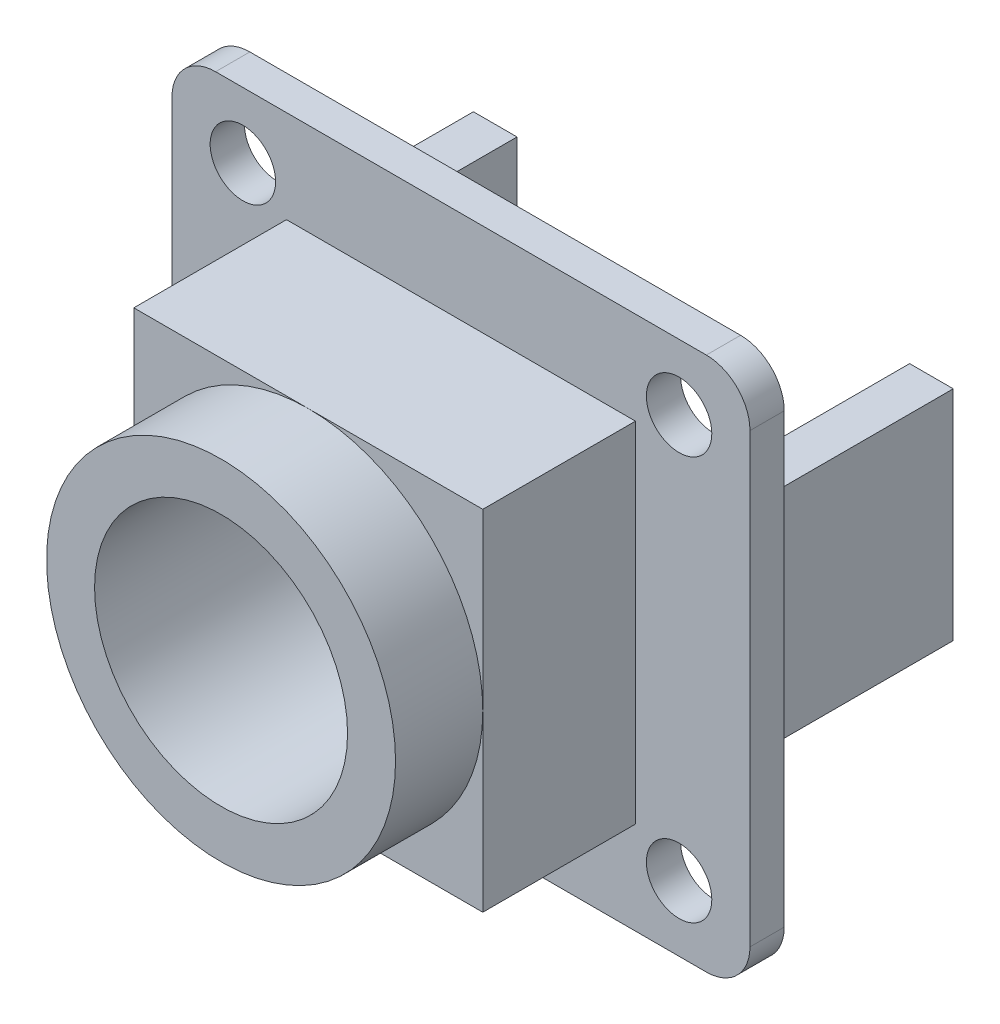
ISO-10303-21;
HEADER;
FILE_DESCRIPTION(('STEP AP214'),'2;1');
FILE_NAME('part.step','',(''),(''),'','','');
FILE_SCHEMA(('AUTOMOTIVE_DESIGN { 1 0 10303 214 1 1 1 1 }'));
ENDSEC;
DATA;
#1=APPLICATION_CONTEXT('core data for automotive mechanical design processes');
#2=APPLICATION_PROTOCOL_DEFINITION('international standard','automotive_design',2000,#1);
#3=PRODUCT_CONTEXT('',#1,'mechanical');
#4=PRODUCT('Part','Part','',(#3));
#5=PRODUCT_RELATED_PRODUCT_CATEGORY('part','',(#4));
#6=PRODUCT_DEFINITION_FORMATION('','',#4);
#7=PRODUCT_DEFINITION_CONTEXT('part definition',#1,'design');
#8=PRODUCT_DEFINITION('design','',#6,#7);
#9=PRODUCT_DEFINITION_SHAPE('','',#8);
#10=(LENGTH_UNIT() NAMED_UNIT(*) SI_UNIT(.MILLI.,.METRE.));
#11=(NAMED_UNIT(*) PLANE_ANGLE_UNIT() SI_UNIT($,.RADIAN.));
#12=(NAMED_UNIT(*) SI_UNIT($,.STERADIAN.) SOLID_ANGLE_UNIT());
#13=UNCERTAINTY_MEASURE_WITH_UNIT(LENGTH_MEASURE(1.E-05),#10,'distance_accuracy_value','');
#14=(GEOMETRIC_REPRESENTATION_CONTEXT(3) GLOBAL_UNCERTAINTY_ASSIGNED_CONTEXT((#13)) GLOBAL_UNIT_ASSIGNED_CONTEXT((#10,
#11,#12)) REPRESENTATION_CONTEXT('',''));
#15=CARTESIAN_POINT('',(0.,0.,0.));
#16=DIRECTION('',(0.,0.,1.));
#17=DIRECTION('',(1.,0.,0.));
#18=AXIS2_PLACEMENT_3D('',#15,#16,#17);
#19=CARTESIAN_POINT('',(0.,0.,8.57));
#20=DIRECTION('',(0.,0.,1.));
#21=DIRECTION('',(1.,0.,0.));
#22=AXIS2_PLACEMENT_3D('',#19,#20,#21);
#23=PLANE('',#22);
#24=CARTESIAN_POINT('',(0.,0.,8.57));
#25=DIRECTION('',(0.,0.,1.));
#26=DIRECTION('',(1.,0.,0.));
#27=AXIS2_PLACEMENT_3D('',#24,#25,#26);
#28=CIRCLE('',#27,8.);
#29=CARTESIAN_POINT('',(8.,0.,8.57));
#30=VERTEX_POINT('',#29);
#31=CARTESIAN_POINT('',(0.,8.,8.57));
#32=VERTEX_POINT('',#31);
#33=EDGE_CURVE('E258',#30,#32,#28,.T.);
#34=ORIENTED_EDGE('',*,*,#33,.F.);
#35=DIRECTION('',(0.,1.,0.));
#36=VECTOR('',#35,1.);
#37=CARTESIAN_POINT('',(8.00000000000001,-8.00000000000001,8.57));
#38=LINE('',#37,#36);
#39=CARTESIAN_POINT('',(8.,8.,8.57));
#40=VERTEX_POINT('',#39);
#41=EDGE_CURVE('E270',#30,#40,#38,.T.);
#42=ORIENTED_EDGE('',*,*,#41,.T.);
#43=DIRECTION('',(-1.,0.,0.));
#44=VECTOR('',#43,1.);
#45=CARTESIAN_POINT('',(8.,8.,8.57));
#46=LINE('',#45,#44);
#47=EDGE_CURVE('E275',#40,#32,#46,.T.);
#48=ORIENTED_EDGE('',*,*,#47,.T.);
#49=EDGE_LOOP('',(#34,#42,#48));
#50=FACE_BOUND('',#49,.T.);
#51=ADVANCED_FACE('F34',(#50),#23,.T.);
#52=CARTESIAN_POINT('',(-8.,0.,8.57));
#53=VERTEX_POINT('',#52);
#54=EDGE_CURVE('E262',#32,#53,#28,.T.);
#55=ORIENTED_EDGE('',*,*,#54,.F.);
#56=CARTESIAN_POINT('',(-8.,8.,8.57));
#57=VERTEX_POINT('',#56);
#58=EDGE_CURVE('E274',#32,#57,#46,.T.);
#59=ORIENTED_EDGE('',*,*,#58,.T.);
#60=DIRECTION('',(0.,-1.,0.));
#61=VECTOR('',#60,1.);
#62=CARTESIAN_POINT('',(-8.,8.,8.57));
#63=LINE('',#62,#61);
#64=EDGE_CURVE('E279',#57,#53,#63,.T.);
#65=ORIENTED_EDGE('',*,*,#64,.T.);
#66=EDGE_LOOP('',(#55,#59,#65));
#67=FACE_BOUND('',#66,.T.);
#68=ADVANCED_FACE('F431',(#67),#23,.T.);
#69=CARTESIAN_POINT('',(0.,-8.00000000000001,8.57));
#70=VERTEX_POINT('',#69);
#71=EDGE_CURVE('E465',#53,#70,#28,.T.);
#72=ORIENTED_EDGE('',*,*,#71,.F.);
#73=CARTESIAN_POINT('',(-8.,-8.00000000000001,8.57));
#74=VERTEX_POINT('',#73);
#75=EDGE_CURVE('E278',#53,#74,#63,.T.);
#76=ORIENTED_EDGE('',*,*,#75,.T.);
#77=DIRECTION('',(1.,0.,0.));
#78=VECTOR('',#77,1.);
#79=CARTESIAN_POINT('',(-8.,-8.00000000000001,8.57));
#80=LINE('',#79,#78);
#81=EDGE_CURVE('E267',#74,#70,#80,.T.);
#82=ORIENTED_EDGE('',*,*,#81,.T.);
#83=EDGE_LOOP('',(#72,#76,#82));
#84=FACE_BOUND('',#83,.T.);
#85=ADVANCED_FACE('F438',(#84),#23,.T.);
#86=CARTESIAN_POINT('',(0.,0.,1.57));
#87=DIRECTION('',(0.,0.,1.));
#88=DIRECTION('',(1.,0.,0.));
#89=AXIS2_PLACEMENT_3D('',#86,#87,#88);
#90=PLANE('',#89);
#91=CARTESIAN_POINT('',(10.,-9.25,1.57));
#92=DIRECTION('',(0.,0.,1.));
#93=DIRECTION('',(1.,0.,0.));
#94=AXIS2_PLACEMENT_3D('',#91,#92,#93);
#95=CIRCLE('',#94,1.5);
#96=CARTESIAN_POINT('',(11.5,-9.25,1.57));
#97=VERTEX_POINT('',#96);
#98=EDGE_CURVE('E308',#97,#97,#95,.T.);
#99=ORIENTED_EDGE('',*,*,#98,.F.);
#100=EDGE_LOOP('',(#99));
#101=FACE_BOUND('',#100,.T.);
#102=CARTESIAN_POINT('',(-10.,9.25,1.57));
#103=DIRECTION('',(0.,0.,1.));
#104=DIRECTION('',(1.,0.,0.));
#105=AXIS2_PLACEMENT_3D('',#102,#103,#104);
#106=CIRCLE('',#105,1.5);
#107=CARTESIAN_POINT('',(-8.5,9.25,1.57));
#108=VERTEX_POINT('',#107);
#109=EDGE_CURVE('E320',#108,#108,#106,.T.);
#110=ORIENTED_EDGE('',*,*,#109,.F.);
#111=EDGE_LOOP('',(#110));
#112=FACE_BOUND('',#111,.T.);
#113=DIRECTION('',(1.,0.,0.));
#114=VECTOR('',#113,1.);
#115=CARTESIAN_POINT('',(-13.25,-12.25,1.57));
#116=LINE('',#115,#114);
#117=CARTESIAN_POINT('',(-11.25,-12.25,1.57));
#118=VERTEX_POINT('',#117);
#119=CARTESIAN_POINT('',(11.25,-12.25,1.57));
#120=VERTEX_POINT('',#119);
#121=EDGE_CURVE('E336',#118,#120,#116,.T.);
#122=ORIENTED_EDGE('',*,*,#121,.T.);
#123=CARTESIAN_POINT('',(11.25,-10.25,1.57));
#124=DIRECTION('',(0.,0.,1.));
#125=DIRECTION('',(1.,0.,0.));
#126=AXIS2_PLACEMENT_3D('',#123,#124,#125);
#127=CIRCLE('',#126,2.);
#128=CARTESIAN_POINT('',(13.25,-10.25,1.57));
#129=VERTEX_POINT('',#128);
#130=EDGE_CURVE('E373',#120,#129,#127,.T.);
#131=ORIENTED_EDGE('',*,*,#130,.T.);
#132=DIRECTION('',(0.,1.,0.));
#133=VECTOR('',#132,1.);
#134=CARTESIAN_POINT('',(13.25,12.25,1.57));
#135=LINE('',#134,#133);
#136=CARTESIAN_POINT('',(13.25,10.25,1.57));
#137=VERTEX_POINT('',#136);
#138=EDGE_CURVE('E326',#129,#137,#135,.T.);
#139=ORIENTED_EDGE('',*,*,#138,.T.);
#140=CARTESIAN_POINT('',(11.25,10.25,1.57));
#141=DIRECTION('',(0.,0.,1.));
#142=DIRECTION('',(1.,0.,0.));
#143=AXIS2_PLACEMENT_3D('',#140,#141,#142);
#144=CIRCLE('',#143,2.);
#145=CARTESIAN_POINT('',(11.25,12.25,1.57));
#146=VERTEX_POINT('',#145);
#147=EDGE_CURVE('E371',#137,#146,#144,.T.);
#148=ORIENTED_EDGE('',*,*,#147,.T.);
#149=DIRECTION('',(-1.,0.,0.));
#150=VECTOR('',#149,1.);
#151=CARTESIAN_POINT('',(-13.25,12.25,1.57));
#152=LINE('',#151,#150);
#153=CARTESIAN_POINT('',(-11.25,12.25,1.57));
#154=VERTEX_POINT('',#153);
#155=EDGE_CURVE('E329',#146,#154,#152,.T.);
#156=ORIENTED_EDGE('',*,*,#155,.T.);
#157=CARTESIAN_POINT('',(-11.25,10.25,1.57));
#158=DIRECTION('',(0.,0.,1.));
#159=DIRECTION('',(1.,0.,0.));
#160=AXIS2_PLACEMENT_3D('',#157,#158,#159);
#161=CIRCLE('',#160,2.);
#162=CARTESIAN_POINT('',(-13.25,10.25,1.57));
#163=VERTEX_POINT('',#162);
#164=EDGE_CURVE('E367',#154,#163,#161,.T.);
#165=ORIENTED_EDGE('',*,*,#164,.T.);
#166=DIRECTION('',(0.,-1.,0.));
#167=VECTOR('',#166,1.);
#168=CARTESIAN_POINT('',(-13.25,12.25,1.57));
#169=LINE('',#168,#167);
#170=CARTESIAN_POINT('',(-13.25,-10.25,1.57));
#171=VERTEX_POINT('',#170);
#172=EDGE_CURVE('E333',#163,#171,#169,.T.);
#173=ORIENTED_EDGE('',*,*,#172,.T.);
#174=CARTESIAN_POINT('',(-11.25,-10.25,1.57));
#175=DIRECTION('',(0.,0.,1.));
#176=DIRECTION('',(1.,0.,0.));
#177=AXIS2_PLACEMENT_3D('',#174,#175,#176);
#178=CIRCLE('',#177,2.);
#179=EDGE_CURVE('E369',#171,#118,#178,.T.);
#180=ORIENTED_EDGE('',*,*,#179,.T.);
#181=EDGE_LOOP('',(#122,#131,#139,#148,#156,#165,#173,#180));
#182=FACE_BOUND('',#181,.T.);
#183=CARTESIAN_POINT('',(10.,9.25,1.57));
#184=DIRECTION('',(0.,0.,1.));
#185=DIRECTION('',(1.,0.,0.));
#186=AXIS2_PLACEMENT_3D('',#183,#184,#185);
#187=CIRCLE('',#186,1.5);
#188=CARTESIAN_POINT('',(11.5,9.25,1.57));
#189=VERTEX_POINT('',#188);
#190=EDGE_CURVE('E314',#189,#189,#187,.T.);
#191=ORIENTED_EDGE('',*,*,#190,.F.);
#192=EDGE_LOOP('',(#191));
#193=FACE_BOUND('',#192,.T.);
#194=CARTESIAN_POINT('',(-10.,-9.25,1.57));
#195=DIRECTION('',(0.,0.,1.));
#196=DIRECTION('',(1.,0.,0.));
#197=AXIS2_PLACEMENT_3D('',#194,#195,#196);
#198=CIRCLE('',#197,1.5);
#199=CARTESIAN_POINT('',(-8.5,-9.25,1.57));
#200=VERTEX_POINT('',#199);
#201=EDGE_CURVE('E302',#200,#200,#198,.T.);
#202=ORIENTED_EDGE('',*,*,#201,.F.);
#203=EDGE_LOOP('',(#202));
#204=FACE_BOUND('',#203,.T.);
#205=DIRECTION('',(0.,1.,0.));
#206=VECTOR('',#205,1.);
#207=CARTESIAN_POINT('',(8.00000000000001,-8.00000000000001,1.57));
#208=LINE('',#207,#206);
#209=CARTESIAN_POINT('',(8.00000000000001,-8.00000000000001,1.57));
#210=VERTEX_POINT('',#209);
#211=CARTESIAN_POINT('',(8.,8.,1.57));
#212=VERTEX_POINT('',#211);
#213=EDGE_CURVE('E285',#210,#212,#208,.T.);
#214=ORIENTED_EDGE('',*,*,#213,.F.);
#215=DIRECTION('',(1.,0.,0.));
#216=VECTOR('',#215,1.);
#217=CARTESIAN_POINT('',(-8.,-8.00000000000001,1.57));
#218=LINE('',#217,#216);
#219=CARTESIAN_POINT('',(-8.,-8.00000000000001,1.57));
#220=VERTEX_POINT('',#219);
#221=EDGE_CURVE('E266',#220,#210,#218,.T.);
#222=ORIENTED_EDGE('',*,*,#221,.F.);
#223=DIRECTION('',(0.,-1.,0.));
#224=VECTOR('',#223,1.);
#225=CARTESIAN_POINT('',(-8.,8.,1.57));
#226=LINE('',#225,#224);
#227=CARTESIAN_POINT('',(-8.,8.,1.57));
#228=VERTEX_POINT('',#227);
#229=EDGE_CURVE('E290',#228,#220,#226,.T.);
#230=ORIENTED_EDGE('',*,*,#229,.F.);
#231=DIRECTION('',(-1.,0.,0.));
#232=VECTOR('',#231,1.);
#233=CARTESIAN_POINT('',(8.,8.,1.57));
#234=LINE('',#233,#232);
#235=EDGE_CURVE('E287',#212,#228,#234,.T.);
#236=ORIENTED_EDGE('',*,*,#235,.F.);
#237=EDGE_LOOP('',(#214,#222,#230,#236));
#238=FACE_BOUND('',#237,.T.);
#239=ADVANCED_FACE('F404',(#101,#112,#182,#193,#204,#238),#90,.T.);
#240=CARTESIAN_POINT('',(0.,0.,0.));
#241=DIRECTION('',(0.,0.,1.));
#242=DIRECTION('',(1.,0.,0.));
#243=AXIS2_PLACEMENT_3D('',#240,#241,#242);
#244=PLANE('',#243);
#245=DIRECTION('',(1.,0.,0.));
#246=VECTOR('',#245,1.);
#247=CARTESIAN_POINT('',(0.,5.,0.));
#248=LINE('',#247,#246);
#249=CARTESIAN_POINT('',(-11.,5.,0.));
#250=VERTEX_POINT('',#249);
#251=CARTESIAN_POINT('',(-9.,5.,0.));
#252=VERTEX_POINT('',#251);
#253=EDGE_CURVE('E216',#250,#252,#248,.T.);
#254=ORIENTED_EDGE('',*,*,#253,.F.);
#255=DIRECTION('',(0.,-1.,0.));
#256=VECTOR('',#255,1.);
#257=CARTESIAN_POINT('',(-11.,0.,0.));
#258=LINE('',#257,#256);
#259=CARTESIAN_POINT('',(-11.,-4.99999999999999,0.));
#260=VERTEX_POINT('',#259);
#261=EDGE_CURVE('E191',#250,#260,#258,.T.);
#262=ORIENTED_EDGE('',*,*,#261,.T.);
#263=DIRECTION('',(1.,0.,0.));
#264=VECTOR('',#263,1.);
#265=CARTESIAN_POINT('',(0.,-4.99999999999999,0.));
#266=LINE('',#265,#264);
#267=CARTESIAN_POINT('',(-9.,-4.99999999999999,0.));
#268=VERTEX_POINT('',#267);
#269=EDGE_CURVE('E207',#260,#268,#266,.T.);
#270=ORIENTED_EDGE('',*,*,#269,.T.);
#271=DIRECTION('',(0.,-1.,0.));
#272=VECTOR('',#271,1.);
#273=CARTESIAN_POINT('',(-9.,0.,0.));
#274=LINE('',#273,#272);
#275=EDGE_CURVE('E49',#252,#268,#274,.T.);
#276=ORIENTED_EDGE('',*,*,#275,.F.);
#277=EDGE_LOOP('',(#254,#262,#270,#276));
#278=FACE_BOUND('',#277,.T.);
#279=DIRECTION('',(-1.,0.,0.));
#280=VECTOR('',#279,1.);
#281=CARTESIAN_POINT('',(0.,5.,0.));
#282=LINE('',#281,#280);
#283=CARTESIAN_POINT('',(11.,5.,0.));
#284=VERTEX_POINT('',#283);
#285=CARTESIAN_POINT('',(9.,5.,0.));
#286=VERTEX_POINT('',#285);
#287=EDGE_CURVE('E57',#284,#286,#282,.T.);
#288=ORIENTED_EDGE('',*,*,#287,.T.);
#289=DIRECTION('',(0.,-1.,0.));
#290=VECTOR('',#289,1.);
#291=CARTESIAN_POINT('',(9.,0.,0.));
#292=LINE('',#291,#290);
#293=CARTESIAN_POINT('',(9.,-5.,0.));
#294=VERTEX_POINT('',#293);
#295=EDGE_CURVE('E194',#286,#294,#292,.T.);
#296=ORIENTED_EDGE('',*,*,#295,.T.);
#297=DIRECTION('',(-1.,0.,0.));
#298=VECTOR('',#297,1.);
#299=CARTESIAN_POINT('',(0.,-5.,0.));
#300=LINE('',#299,#298);
#301=CARTESIAN_POINT('',(11.,-5.,0.));
#302=VERTEX_POINT('',#301);
#303=EDGE_CURVE('E227',#302,#294,#300,.T.);
#304=ORIENTED_EDGE('',*,*,#303,.F.);
#305=DIRECTION('',(0.,-1.,0.));
#306=VECTOR('',#305,1.);
#307=CARTESIAN_POINT('',(11.,0.,0.));
#308=LINE('',#307,#306);
#309=EDGE_CURVE('E237',#284,#302,#308,.T.);
#310=ORIENTED_EDGE('',*,*,#309,.F.);
#311=EDGE_LOOP('',(#288,#296,#304,#310));
#312=FACE_BOUND('',#311,.T.);
#313=DIRECTION('',(0.,1.,0.));
#314=VECTOR('',#313,1.);
#315=CARTESIAN_POINT('',(13.25,12.25,0.));
#316=LINE('',#315,#314);
#317=CARTESIAN_POINT('',(13.25,-10.25,0.));
#318=VERTEX_POINT('',#317);
#319=CARTESIAN_POINT('',(13.25,10.25,0.));
#320=VERTEX_POINT('',#319);
#321=EDGE_CURVE('E323',#318,#320,#316,.T.);
#322=ORIENTED_EDGE('',*,*,#321,.F.);
#323=CARTESIAN_POINT('',(11.25,-10.25,0.));
#324=DIRECTION('',(0.,0.,1.));
#325=DIRECTION('',(1.,0.,0.));
#326=AXIS2_PLACEMENT_3D('',#323,#324,#325);
#327=CIRCLE('',#326,2.);
#328=CARTESIAN_POINT('',(11.25,-12.25,0.));
#329=VERTEX_POINT('',#328);
#330=EDGE_CURVE('E360',#318,#329,#327,.F.);
#331=ORIENTED_EDGE('',*,*,#330,.T.);
#332=DIRECTION('',(1.,0.,0.));
#333=VECTOR('',#332,1.);
#334=CARTESIAN_POINT('',(-13.25,-12.25,0.));
#335=LINE('',#334,#333);
#336=CARTESIAN_POINT('',(-11.25,-12.25,0.));
#337=VERTEX_POINT('',#336);
#338=EDGE_CURVE('E330',#337,#329,#335,.T.);
#339=ORIENTED_EDGE('',*,*,#338,.F.);
#340=CARTESIAN_POINT('',(-11.25,-10.25,0.));
#341=DIRECTION('',(0.,0.,1.));
#342=DIRECTION('',(1.,0.,0.));
#343=AXIS2_PLACEMENT_3D('',#340,#341,#342);
#344=CIRCLE('',#343,2.);
#345=CARTESIAN_POINT('',(-13.25,-10.25,0.));
#346=VERTEX_POINT('',#345);
#347=EDGE_CURVE('E356',#337,#346,#344,.F.);
#348=ORIENTED_EDGE('',*,*,#347,.T.);
#349=DIRECTION('',(0.,-1.,0.));
#350=VECTOR('',#349,1.);
#351=CARTESIAN_POINT('',(-13.25,12.25,0.));
#352=LINE('',#351,#350);
#353=CARTESIAN_POINT('',(-13.25,10.25,0.));
#354=VERTEX_POINT('',#353);
#355=EDGE_CURVE('E344',#354,#346,#352,.T.);
#356=ORIENTED_EDGE('',*,*,#355,.F.);
#357=CARTESIAN_POINT('',(-11.25,10.25,0.));
#358=DIRECTION('',(0.,0.,1.));
#359=DIRECTION('',(1.,0.,0.));
#360=AXIS2_PLACEMENT_3D('',#357,#358,#359);
#361=CIRCLE('',#360,2.);
#362=CARTESIAN_POINT('',(-11.25,12.25,0.));
#363=VERTEX_POINT('',#362);
#364=EDGE_CURVE('E354',#354,#363,#361,.F.);
#365=ORIENTED_EDGE('',*,*,#364,.T.);
#366=DIRECTION('',(-1.,0.,0.));
#367=VECTOR('',#366,1.);
#368=CARTESIAN_POINT('',(-13.25,12.25,0.));
#369=LINE('',#368,#367);
#370=CARTESIAN_POINT('',(11.25,12.25,0.));
#371=VERTEX_POINT('',#370);
#372=EDGE_CURVE('E341',#371,#363,#369,.T.);
#373=ORIENTED_EDGE('',*,*,#372,.F.);
#374=CARTESIAN_POINT('',(11.25,10.25,0.));
#375=DIRECTION('',(0.,0.,1.));
#376=DIRECTION('',(1.,0.,0.));
#377=AXIS2_PLACEMENT_3D('',#374,#375,#376);
#378=CIRCLE('',#377,2.);
#379=EDGE_CURVE('E358',#371,#320,#378,.F.);
#380=ORIENTED_EDGE('',*,*,#379,.T.);
#381=EDGE_LOOP('',(#322,#331,#339,#348,#356,#365,#373,#380));
#382=FACE_BOUND('',#381,.T.);
#383=CARTESIAN_POINT('',(-10.,9.25,0.));
#384=DIRECTION('',(0.,0.,1.));
#385=DIRECTION('',(1.,0.,0.));
#386=AXIS2_PLACEMENT_3D('',#383,#384,#385);
#387=CIRCLE('',#386,1.5);
#388=CARTESIAN_POINT('',(-8.5,9.25,0.));
#389=VERTEX_POINT('',#388);
#390=EDGE_CURVE('E317',#389,#389,#387,.T.);
#391=ORIENTED_EDGE('',*,*,#390,.T.);
#392=EDGE_LOOP('',(#391));
#393=FACE_BOUND('',#392,.T.);
#394=CARTESIAN_POINT('',(10.,9.25,0.));
#395=DIRECTION('',(0.,0.,1.));
#396=DIRECTION('',(1.,0.,0.));
#397=AXIS2_PLACEMENT_3D('',#394,#395,#396);
#398=CIRCLE('',#397,1.5);
#399=CARTESIAN_POINT('',(11.5,9.25,0.));
#400=VERTEX_POINT('',#399);
#401=EDGE_CURVE('E311',#400,#400,#398,.T.);
#402=ORIENTED_EDGE('',*,*,#401,.T.);
#403=EDGE_LOOP('',(#402));
#404=FACE_BOUND('',#403,.T.);
#405=CARTESIAN_POINT('',(10.,-9.25,0.));
#406=DIRECTION('',(0.,0.,1.));
#407=DIRECTION('',(1.,0.,0.));
#408=AXIS2_PLACEMENT_3D('',#405,#406,#407);
#409=CIRCLE('',#408,1.5);
#410=CARTESIAN_POINT('',(11.5,-9.25,0.));
#411=VERTEX_POINT('',#410);
#412=EDGE_CURVE('E305',#411,#411,#409,.T.);
#413=ORIENTED_EDGE('',*,*,#412,.T.);
#414=EDGE_LOOP('',(#413));
#415=FACE_BOUND('',#414,.T.);
#416=CARTESIAN_POINT('',(-10.,-9.25,0.));
#417=DIRECTION('',(0.,0.,1.));
#418=DIRECTION('',(1.,0.,0.));
#419=AXIS2_PLACEMENT_3D('',#416,#417,#418);
#420=CIRCLE('',#419,1.5);
#421=CARTESIAN_POINT('',(-8.5,-9.25,0.));
#422=VERTEX_POINT('',#421);
#423=EDGE_CURVE('E301',#422,#422,#420,.T.);
#424=ORIENTED_EDGE('',*,*,#423,.T.);
#425=EDGE_LOOP('',(#424));
#426=FACE_BOUND('',#425,.T.);
#427=ADVANCED_FACE('F390',(#278,#312,#382,#393,#404,#415,#426),#244,.F.);
#428=CARTESIAN_POINT('',(13.25,12.25,1.57));
#429=DIRECTION('',(-1.,0.,0.));
#430=DIRECTION('',(0.,0.,1.));
#431=AXIS2_PLACEMENT_3D('',#428,#429,#430);
#432=PLANE('',#431);
#433=ORIENTED_EDGE('',*,*,#138,.F.);
#434=DIRECTION('',(0.,0.,-1.));
#435=VECTOR('',#434,1.);
#436=CARTESIAN_POINT('',(13.25,-10.25,1.57));
#437=LINE('',#436,#435);
#438=EDGE_CURVE('E351',#129,#318,#437,.T.);
#439=ORIENTED_EDGE('',*,*,#438,.T.);
#440=ORIENTED_EDGE('',*,*,#321,.T.);
#441=DIRECTION('',(0.,0.,-1.));
#442=VECTOR('',#441,1.);
#443=CARTESIAN_POINT('',(13.25,10.25,1.57));
#444=LINE('',#443,#442);
#445=EDGE_CURVE('E349',#320,#137,#444,.F.);
#446=ORIENTED_EDGE('',*,*,#445,.T.);
#447=EDGE_LOOP('',(#433,#439,#440,#446));
#448=FACE_BOUND('',#447,.T.);
#449=ADVANCED_FACE('F411',(#448),#432,.F.);
#450=CARTESIAN_POINT('',(-13.25,12.25,1.57));
#451=DIRECTION('',(0.,-1.,0.));
#452=DIRECTION('',(0.,0.,-1.));
#453=AXIS2_PLACEMENT_3D('',#450,#451,#452);
#454=PLANE('',#453);
#455=ORIENTED_EDGE('',*,*,#155,.F.);
#456=DIRECTION('',(0.,0.,-1.));
#457=VECTOR('',#456,1.);
#458=CARTESIAN_POINT('',(11.25,12.25,1.57));
#459=LINE('',#458,#457);
#460=EDGE_CURVE('E377',#146,#371,#459,.T.);
#461=ORIENTED_EDGE('',*,*,#460,.T.);
#462=ORIENTED_EDGE('',*,*,#372,.T.);
#463=DIRECTION('',(0.,0.,-1.));
#464=VECTOR('',#463,1.);
#465=CARTESIAN_POINT('',(-11.25,12.25,1.57));
#466=LINE('',#465,#464);
#467=EDGE_CURVE('E375',#363,#154,#466,.F.);
#468=ORIENTED_EDGE('',*,*,#467,.T.);
#469=EDGE_LOOP('',(#455,#461,#462,#468));
#470=FACE_BOUND('',#469,.T.);
#471=ADVANCED_FACE('F419',(#470),#454,.F.);
#472=CARTESIAN_POINT('',(-13.25,12.25,1.57));
#473=DIRECTION('',(1.,0.,0.));
#474=DIRECTION('',(0.,0.,-1.));
#475=AXIS2_PLACEMENT_3D('',#472,#473,#474);
#476=PLANE('',#475);
#477=ORIENTED_EDGE('',*,*,#355,.T.);
#478=DIRECTION('',(0.,0.,-1.));
#479=VECTOR('',#478,1.);
#480=CARTESIAN_POINT('',(-13.25,-10.25,1.57));
#481=LINE('',#480,#479);
#482=EDGE_CURVE('E11',#346,#171,#481,.F.);
#483=ORIENTED_EDGE('',*,*,#482,.T.);
#484=ORIENTED_EDGE('',*,*,#172,.F.);
#485=DIRECTION('',(0.,0.,-1.));
#486=VECTOR('',#485,1.);
#487=CARTESIAN_POINT('',(-13.25,10.25,1.57));
#488=LINE('',#487,#486);
#489=EDGE_CURVE('E42',#163,#354,#488,.T.);
#490=ORIENTED_EDGE('',*,*,#489,.T.);
#491=EDGE_LOOP('',(#477,#483,#484,#490));
#492=FACE_BOUND('',#491,.T.);
#493=ADVANCED_FACE('F384',(#492),#476,.F.);
#494=CARTESIAN_POINT('',(-13.25,-12.25,1.57));
#495=DIRECTION('',(0.,1.,0.));
#496=DIRECTION('',(0.,0.,1.));
#497=AXIS2_PLACEMENT_3D('',#494,#495,#496);
#498=PLANE('',#497);
#499=ORIENTED_EDGE('',*,*,#338,.T.);
#500=DIRECTION('',(0.,0.,-1.));
#501=VECTOR('',#500,1.);
#502=CARTESIAN_POINT('',(11.25,-12.25,1.57));
#503=LINE('',#502,#501);
#504=EDGE_CURVE('E365',#329,#120,#503,.F.);
#505=ORIENTED_EDGE('',*,*,#504,.T.);
#506=ORIENTED_EDGE('',*,*,#121,.F.);
#507=DIRECTION('',(0.,0.,-1.));
#508=VECTOR('',#507,1.);
#509=CARTESIAN_POINT('',(-11.25,-12.25,1.57));
#510=LINE('',#509,#508);
#511=EDGE_CURVE('E362',#118,#337,#510,.T.);
#512=ORIENTED_EDGE('',*,*,#511,.T.);
#513=EDGE_LOOP('',(#499,#505,#506,#512));
#514=FACE_BOUND('',#513,.T.);
#515=ADVANCED_FACE('F400',(#514),#498,.F.);
#516=CARTESIAN_POINT('',(-10.,9.25,1.57));
#517=DIRECTION('',(0.,0.,-1.));
#518=DIRECTION('',(-1.,0.,0.));
#519=AXIS2_PLACEMENT_3D('',#516,#517,#518);
#520=CYLINDRICAL_SURFACE('',#519,1.5);
#521=ORIENTED_EDGE('',*,*,#109,.T.);
#522=EDGE_LOOP('',(#521));
#523=FACE_BOUND('',#522,.T.);
#524=ORIENTED_EDGE('',*,*,#390,.F.);
#525=EDGE_LOOP('',(#524));
#526=FACE_BOUND('',#525,.T.);
#527=ADVANCED_FACE('F511',(#523,#526),#520,.F.);
#528=CARTESIAN_POINT('',(10.,9.25,1.57));
#529=DIRECTION('',(0.,0.,-1.));
#530=DIRECTION('',(-1.,0.,0.));
#531=AXIS2_PLACEMENT_3D('',#528,#529,#530);
#532=CYLINDRICAL_SURFACE('',#531,1.5);
#533=ORIENTED_EDGE('',*,*,#190,.T.);
#534=EDGE_LOOP('',(#533));
#535=FACE_BOUND('',#534,.T.);
#536=ORIENTED_EDGE('',*,*,#401,.F.);
#537=EDGE_LOOP('',(#536));
#538=FACE_BOUND('',#537,.T.);
#539=ADVANCED_FACE('F507',(#535,#538),#532,.F.);
#540=CARTESIAN_POINT('',(10.,-9.25,1.57));
#541=DIRECTION('',(0.,0.,-1.));
#542=DIRECTION('',(-1.,0.,0.));
#543=AXIS2_PLACEMENT_3D('',#540,#541,#542);
#544=CYLINDRICAL_SURFACE('',#543,1.5);
#545=ORIENTED_EDGE('',*,*,#98,.T.);
#546=EDGE_LOOP('',(#545));
#547=FACE_BOUND('',#546,.T.);
#548=ORIENTED_EDGE('',*,*,#412,.F.);
#549=EDGE_LOOP('',(#548));
#550=FACE_BOUND('',#549,.T.);
#551=ADVANCED_FACE('F503',(#547,#550),#544,.F.);
#552=CARTESIAN_POINT('',(-10.,-9.25,1.57));
#553=DIRECTION('',(0.,0.,-1.));
#554=DIRECTION('',(-1.,0.,0.));
#555=AXIS2_PLACEMENT_3D('',#552,#553,#554);
#556=CYLINDRICAL_SURFACE('',#555,1.5);
#557=ORIENTED_EDGE('',*,*,#201,.T.);
#558=EDGE_LOOP('',(#557));
#559=FACE_BOUND('',#558,.T.);
#560=ORIENTED_EDGE('',*,*,#423,.F.);
#561=EDGE_LOOP('',(#560));
#562=FACE_BOUND('',#561,.T.);
#563=ADVANCED_FACE('F498',(#559,#562),#556,.F.);
#564=CARTESIAN_POINT('',(-8.,-8.00000000000001,8.57));
#565=DIRECTION('',(0.,1.,0.));
#566=DIRECTION('',(0.,0.,1.));
#567=AXIS2_PLACEMENT_3D('',#564,#565,#566);
#568=PLANE('',#567);
#569=ORIENTED_EDGE('',*,*,#221,.T.);
#570=DIRECTION('',(0.,0.,-1.));
#571=VECTOR('',#570,1.);
#572=CARTESIAN_POINT('',(8.00000000000001,-8.00000000000001,8.57));
#573=LINE('',#572,#571);
#574=CARTESIAN_POINT('',(8.00000000000001,-8.00000000000001,8.57));
#575=VERTEX_POINT('',#574);
#576=EDGE_CURVE('E299',#575,#210,#573,.T.);
#577=ORIENTED_EDGE('',*,*,#576,.F.);
#578=EDGE_CURVE('E271',#70,#575,#80,.T.);
#579=ORIENTED_EDGE('',*,*,#578,.F.);
#580=ORIENTED_EDGE('',*,*,#81,.F.);
#581=DIRECTION('',(0.,0.,-1.));
#582=VECTOR('',#581,1.);
#583=CARTESIAN_POINT('',(-8.,-8.00000000000001,8.57));
#584=LINE('',#583,#582);
#585=EDGE_CURVE('E282',#74,#220,#584,.T.);
#586=ORIENTED_EDGE('',*,*,#585,.T.);
#587=EDGE_LOOP('',(#569,#577,#579,#580,#586));
#588=FACE_BOUND('',#587,.T.);
#589=ADVANCED_FACE('F484',(#588),#568,.F.);
#590=CARTESIAN_POINT('',(8.00000000000001,-8.00000000000001,8.57));
#591=DIRECTION('',(-1.,0.,0.));
#592=DIRECTION('',(0.,-1.,0.));
#593=AXIS2_PLACEMENT_3D('',#590,#591,#592);
#594=PLANE('',#593);
#595=ORIENTED_EDGE('',*,*,#213,.T.);
#596=DIRECTION('',(0.,0.,-1.));
#597=VECTOR('',#596,1.);
#598=CARTESIAN_POINT('',(8.,8.,8.57));
#599=LINE('',#598,#597);
#600=EDGE_CURVE('E296',#40,#212,#599,.T.);
#601=ORIENTED_EDGE('',*,*,#600,.F.);
#602=ORIENTED_EDGE('',*,*,#41,.F.);
#603=EDGE_CURVE('E272',#575,#30,#38,.T.);
#604=ORIENTED_EDGE('',*,*,#603,.F.);
#605=ORIENTED_EDGE('',*,*,#576,.T.);
#606=EDGE_LOOP('',(#595,#601,#602,#604,#605));
#607=FACE_BOUND('',#606,.T.);
#608=ADVANCED_FACE('F489',(#607),#594,.F.);
#609=CARTESIAN_POINT('',(8.,8.,8.57));
#610=DIRECTION('',(0.,-1.,0.));
#611=DIRECTION('',(0.,0.,-1.));
#612=AXIS2_PLACEMENT_3D('',#609,#610,#611);
#613=PLANE('',#612);
#614=ORIENTED_EDGE('',*,*,#235,.T.);
#615=DIRECTION('',(0.,0.,-1.));
#616=VECTOR('',#615,1.);
#617=CARTESIAN_POINT('',(-8.,8.,8.57));
#618=LINE('',#617,#616);
#619=EDGE_CURVE('E294',#57,#228,#618,.T.);
#620=ORIENTED_EDGE('',*,*,#619,.F.);
#621=ORIENTED_EDGE('',*,*,#58,.F.);
#622=ORIENTED_EDGE('',*,*,#47,.F.);
#623=ORIENTED_EDGE('',*,*,#600,.T.);
#624=EDGE_LOOP('',(#614,#620,#621,#622,#623));
#625=FACE_BOUND('',#624,.T.);
#626=ADVANCED_FACE('F454',(#625),#613,.F.);
#627=CARTESIAN_POINT('',(-8.,8.,8.57));
#628=DIRECTION('',(1.,0.,0.));
#629=DIRECTION('',(0.,1.,0.));
#630=AXIS2_PLACEMENT_3D('',#627,#628,#629);
#631=PLANE('',#630);
#632=ORIENTED_EDGE('',*,*,#229,.T.);
#633=ORIENTED_EDGE('',*,*,#585,.F.);
#634=ORIENTED_EDGE('',*,*,#75,.F.);
#635=ORIENTED_EDGE('',*,*,#64,.F.);
#636=ORIENTED_EDGE('',*,*,#619,.T.);
#637=EDGE_LOOP('',(#632,#633,#634,#635,#636));
#638=FACE_BOUND('',#637,.T.);
#639=ADVANCED_FACE('F445',(#638),#631,.F.);
#640=EDGE_CURVE('E263',#70,#30,#28,.T.);
#641=ORIENTED_EDGE('',*,*,#640,.F.);
#642=ORIENTED_EDGE('',*,*,#578,.T.);
#643=ORIENTED_EDGE('',*,*,#603,.T.);
#644=EDGE_LOOP('',(#641,#642,#643));
#645=FACE_BOUND('',#644,.T.);
#646=ADVANCED_FACE('F434',(#645),#23,.T.);
#647=CARTESIAN_POINT('',(0.,0.,35.1974169979695));
#648=DIRECTION('',(0.,0.,-1.));
#649=DIRECTION('',(-1.,0.,0.));
#650=AXIS2_PLACEMENT_3D('',#647,#648,#649);
#651=CYLINDRICAL_SURFACE('',#650,8.);
#652=ORIENTED_EDGE('',*,*,#33,.T.);
#653=ORIENTED_EDGE('',*,*,#54,.T.);
#654=ORIENTED_EDGE('',*,*,#71,.T.);
#655=ORIENTED_EDGE('',*,*,#640,.T.);
#656=EDGE_LOOP('',(#652,#653,#654,#655));
#657=FACE_BOUND('',#656,.T.);
#658=CARTESIAN_POINT('',(0.,0.,12.57));
#659=DIRECTION('',(0.,0.,1.));
#660=DIRECTION('',(1.,0.,0.));
#661=AXIS2_PLACEMENT_3D('',#658,#659,#660);
#662=CIRCLE('',#661,8.);
#663=CARTESIAN_POINT('',(8.,0.,12.57));
#664=VERTEX_POINT('',#663);
#665=EDGE_CURVE('E261',#664,#664,#662,.T.);
#666=ORIENTED_EDGE('',*,*,#665,.F.);
#667=EDGE_LOOP('',(#666));
#668=FACE_BOUND('',#667,.T.);
#669=ADVANCED_FACE('F444',(#657,#668),#651,.T.);
#670=CARTESIAN_POINT('',(0.,0.,12.57));
#671=DIRECTION('',(0.,0.,1.));
#672=DIRECTION('',(1.,0.,0.));
#673=AXIS2_PLACEMENT_3D('',#670,#671,#672);
#674=PLANE('',#673);
#675=CARTESIAN_POINT('',(0.,0.,12.57));
#676=DIRECTION('',(0.,0.,1.));
#677=DIRECTION('',(1.,0.,0.));
#678=AXIS2_PLACEMENT_3D('',#675,#676,#677);
#679=CIRCLE('',#678,5.8);
#680=CARTESIAN_POINT('',(5.8,0.,12.57));
#681=VERTEX_POINT('',#680);
#682=EDGE_CURVE('E252',#681,#681,#679,.T.);
#683=ORIENTED_EDGE('',*,*,#682,.F.);
#684=EDGE_LOOP('',(#683));
#685=FACE_BOUND('',#684,.T.);
#686=ORIENTED_EDGE('',*,*,#665,.T.);
#687=EDGE_LOOP('',(#686));
#688=FACE_BOUND('',#687,.T.);
#689=ADVANCED_FACE('F451',(#685,#688),#674,.T.);
#690=CARTESIAN_POINT('',(0.,0.,-14.8348773235279));
#691=DIRECTION('',(0.,0.,1.));
#692=DIRECTION('',(1.,0.,0.));
#693=AXIS2_PLACEMENT_3D('',#690,#691,#692);
#694=CYLINDRICAL_SURFACE('',#693,5.8);
#695=CARTESIAN_POINT('',(0.,0.,1.57));
#696=DIRECTION('',(0.,0.,1.));
#697=DIRECTION('',(1.,0.,0.));
#698=AXIS2_PLACEMENT_3D('',#695,#696,#697);
#699=CIRCLE('',#698,5.8);
#700=CARTESIAN_POINT('',(5.8,0.,1.57));
#701=VERTEX_POINT('',#700);
#702=EDGE_CURVE('E255',#701,#701,#699,.F.);
#703=ORIENTED_EDGE('',*,*,#702,.T.);
#704=EDGE_LOOP('',(#703));
#705=FACE_BOUND('',#704,.T.);
#706=ORIENTED_EDGE('',*,*,#682,.T.);
#707=EDGE_LOOP('',(#706));
#708=FACE_BOUND('',#707,.T.);
#709=ADVANCED_FACE('F643',(#705,#708),#694,.F.);
#710=CARTESIAN_POINT('',(0.,0.,1.57));
#711=DIRECTION('',(0.,0.,1.));
#712=DIRECTION('',(1.,0.,0.));
#713=AXIS2_PLACEMENT_3D('',#710,#711,#712);
#714=PLANE('',#713);
#715=ORIENTED_EDGE('',*,*,#702,.F.);
#716=EDGE_LOOP('',(#715));
#717=FACE_BOUND('',#716,.T.);
#718=ADVANCED_FACE('F529',(#717),#714,.T.);
#719=CARTESIAN_POINT('',(11.25,-10.25,1.57));
#720=DIRECTION('',(0.,0.,-1.));
#721=DIRECTION('',(-1.,0.,0.));
#722=AXIS2_PLACEMENT_3D('',#719,#720,#721);
#723=CYLINDRICAL_SURFACE('',#722,2.);
#724=ORIENTED_EDGE('',*,*,#130,.F.);
#725=ORIENTED_EDGE('',*,*,#504,.F.);
#726=ORIENTED_EDGE('',*,*,#330,.F.);
#727=ORIENTED_EDGE('',*,*,#438,.F.);
#728=EDGE_LOOP('',(#724,#725,#726,#727));
#729=FACE_BOUND('',#728,.T.);
#730=ADVANCED_FACE('F409',(#729),#723,.T.);
#731=CARTESIAN_POINT('',(11.25,10.25,1.57));
#732=DIRECTION('',(0.,0.,-1.));
#733=DIRECTION('',(-1.,0.,0.));
#734=AXIS2_PLACEMENT_3D('',#731,#732,#733);
#735=CYLINDRICAL_SURFACE('',#734,2.);
#736=ORIENTED_EDGE('',*,*,#147,.F.);
#737=ORIENTED_EDGE('',*,*,#445,.F.);
#738=ORIENTED_EDGE('',*,*,#379,.F.);
#739=ORIENTED_EDGE('',*,*,#460,.F.);
#740=EDGE_LOOP('',(#736,#737,#738,#739));
#741=FACE_BOUND('',#740,.T.);
#742=ADVANCED_FACE('F416',(#741),#735,.T.);
#743=CARTESIAN_POINT('',(-11.25,-10.25,1.57));
#744=DIRECTION('',(0.,0.,-1.));
#745=DIRECTION('',(-1.,0.,0.));
#746=AXIS2_PLACEMENT_3D('',#743,#744,#745);
#747=CYLINDRICAL_SURFACE('',#746,2.);
#748=ORIENTED_EDGE('',*,*,#179,.F.);
#749=ORIENTED_EDGE('',*,*,#482,.F.);
#750=ORIENTED_EDGE('',*,*,#347,.F.);
#751=ORIENTED_EDGE('',*,*,#511,.F.);
#752=EDGE_LOOP('',(#748,#749,#750,#751));
#753=FACE_BOUND('',#752,.T.);
#754=ADVANCED_FACE('F397',(#753),#747,.T.);
#755=CARTESIAN_POINT('',(-11.25,10.25,1.57));
#756=DIRECTION('',(0.,0.,-1.));
#757=DIRECTION('',(-1.,0.,0.));
#758=AXIS2_PLACEMENT_3D('',#755,#756,#757);
#759=CYLINDRICAL_SURFACE('',#758,2.);
#760=ORIENTED_EDGE('',*,*,#164,.F.);
#761=ORIENTED_EDGE('',*,*,#467,.F.);
#762=ORIENTED_EDGE('',*,*,#364,.F.);
#763=ORIENTED_EDGE('',*,*,#489,.F.);
#764=EDGE_LOOP('',(#760,#761,#762,#763));
#765=FACE_BOUND('',#764,.T.);
#766=ADVANCED_FACE('F36',(#765),#759,.T.);
#767=CARTESIAN_POINT('',(9.,0.,-10.));
#768=DIRECTION('',(-1.,0.,0.));
#769=DIRECTION('',(0.,0.,1.));
#770=AXIS2_PLACEMENT_3D('',#767,#768,#769);
#771=PLANE('',#770);
#772=ORIENTED_EDGE('',*,*,#295,.F.);
#773=DIRECTION('',(0.,0.,1.));
#774=VECTOR('',#773,1.);
#775=CARTESIAN_POINT('',(9.,5.,-10.));
#776=LINE('',#775,#774);
#777=CARTESIAN_POINT('',(9.,5.,-10.));
#778=VERTEX_POINT('',#777);
#779=EDGE_CURVE('E250',#778,#286,#776,.T.);
#780=ORIENTED_EDGE('',*,*,#779,.F.);
#781=DIRECTION('',(0.,-1.,0.));
#782=VECTOR('',#781,1.);
#783=CARTESIAN_POINT('',(9.,0.,-10.));
#784=LINE('',#783,#782);
#785=CARTESIAN_POINT('',(9.,-5.,-10.));
#786=VERTEX_POINT('',#785);
#787=EDGE_CURVE('E223',#778,#786,#784,.T.);
#788=ORIENTED_EDGE('',*,*,#787,.T.);
#789=DIRECTION('',(0.,0.,1.));
#790=VECTOR('',#789,1.);
#791=CARTESIAN_POINT('',(9.,-5.,-10.));
#792=LINE('',#791,#790);
#793=EDGE_CURVE('E234',#786,#294,#792,.T.);
#794=ORIENTED_EDGE('',*,*,#793,.T.);
#795=EDGE_LOOP('',(#772,#780,#788,#794));
#796=FACE_BOUND('',#795,.T.);
#797=ADVANCED_FACE('F422',(#796),#771,.T.);
#798=CARTESIAN_POINT('',(0.,5.,-10.));
#799=DIRECTION('',(0.,1.,0.));
#800=DIRECTION('',(0.,0.,1.));
#801=AXIS2_PLACEMENT_3D('',#798,#799,#800);
#802=PLANE('',#801);
#803=ORIENTED_EDGE('',*,*,#287,.F.);
#804=DIRECTION('',(0.,0.,1.));
#805=VECTOR('',#804,1.);
#806=CARTESIAN_POINT('',(11.,5.,-10.));
#807=LINE('',#806,#805);
#808=CARTESIAN_POINT('',(11.,5.,-10.));
#809=VERTEX_POINT('',#808);
#810=EDGE_CURVE('E247',#809,#284,#807,.T.);
#811=ORIENTED_EDGE('',*,*,#810,.F.);
#812=DIRECTION('',(-1.,0.,0.));
#813=VECTOR('',#812,1.);
#814=CARTESIAN_POINT('',(0.,5.,-10.));
#815=LINE('',#814,#813);
#816=EDGE_CURVE('E226',#809,#778,#815,.T.);
#817=ORIENTED_EDGE('',*,*,#816,.T.);
#818=ORIENTED_EDGE('',*,*,#779,.T.);
#819=EDGE_LOOP('',(#803,#811,#817,#818));
#820=FACE_BOUND('',#819,.T.);
#821=ADVANCED_FACE('F427',(#820),#802,.T.);
#822=CARTESIAN_POINT('',(11.,0.,-10.));
#823=DIRECTION('',(-1.,0.,0.));
#824=DIRECTION('',(0.,0.,1.));
#825=AXIS2_PLACEMENT_3D('',#822,#823,#824);
#826=PLANE('',#825);
#827=ORIENTED_EDGE('',*,*,#309,.T.);
#828=DIRECTION('',(0.,0.,1.));
#829=VECTOR('',#828,1.);
#830=CARTESIAN_POINT('',(11.,-5.,-10.));
#831=LINE('',#830,#829);
#832=CARTESIAN_POINT('',(11.,-5.,-10.));
#833=VERTEX_POINT('',#832);
#834=EDGE_CURVE('E244',#833,#302,#831,.T.);
#835=ORIENTED_EDGE('',*,*,#834,.F.);
#836=DIRECTION('',(0.,-1.,0.));
#837=VECTOR('',#836,1.);
#838=CARTESIAN_POINT('',(11.,0.,-10.));
#839=LINE('',#838,#837);
#840=EDGE_CURVE('E230',#809,#833,#839,.T.);
#841=ORIENTED_EDGE('',*,*,#840,.F.);
#842=ORIENTED_EDGE('',*,*,#810,.T.);
#843=EDGE_LOOP('',(#827,#835,#841,#842));
#844=FACE_BOUND('',#843,.T.);
#845=ADVANCED_FACE('F564',(#844),#826,.F.);
#846=CARTESIAN_POINT('',(0.,-5.,-10.));
#847=DIRECTION('',(0.,1.,0.));
#848=DIRECTION('',(0.,0.,1.));
#849=AXIS2_PLACEMENT_3D('',#846,#847,#848);
#850=PLANE('',#849);
#851=ORIENTED_EDGE('',*,*,#303,.T.);
#852=ORIENTED_EDGE('',*,*,#793,.F.);
#853=DIRECTION('',(-1.,0.,0.));
#854=VECTOR('',#853,1.);
#855=CARTESIAN_POINT('',(0.,-5.,-10.));
#856=LINE('',#855,#854);
#857=EDGE_CURVE('E232',#833,#786,#856,.T.);
#858=ORIENTED_EDGE('',*,*,#857,.F.);
#859=ORIENTED_EDGE('',*,*,#834,.T.);
#860=EDGE_LOOP('',(#851,#852,#858,#859));
#861=FACE_BOUND('',#860,.T.);
#862=ADVANCED_FACE('F574',(#861),#850,.F.);
#863=CARTESIAN_POINT('',(0.,0.,-10.));
#864=DIRECTION('',(0.,0.,-1.));
#865=DIRECTION('',(-1.,0.,0.));
#866=AXIS2_PLACEMENT_3D('',#863,#864,#865);
#867=PLANE('',#866);
#868=ORIENTED_EDGE('',*,*,#787,.F.);
#869=ORIENTED_EDGE('',*,*,#816,.F.);
#870=ORIENTED_EDGE('',*,*,#840,.T.);
#871=ORIENTED_EDGE('',*,*,#857,.T.);
#872=EDGE_LOOP('',(#868,#869,#870,#871));
#873=FACE_BOUND('',#872,.T.);
#874=ADVANCED_FACE('F584',(#873),#867,.T.);
#875=CARTESIAN_POINT('',(-11.,0.,-10.));
#876=DIRECTION('',(-1.,0.,0.));
#877=DIRECTION('',(0.,0.,1.));
#878=AXIS2_PLACEMENT_3D('',#875,#876,#877);
#879=PLANE('',#878);
#880=ORIENTED_EDGE('',*,*,#261,.F.);
#881=DIRECTION('',(0.,0.,1.));
#882=VECTOR('',#881,1.);
#883=CARTESIAN_POINT('',(-11.,5.,-10.));
#884=LINE('',#883,#882);
#885=CARTESIAN_POINT('',(-11.,5.,-10.));
#886=VERTEX_POINT('',#885);
#887=EDGE_CURVE('E184',#886,#250,#884,.T.);
#888=ORIENTED_EDGE('',*,*,#887,.F.);
#889=DIRECTION('',(0.,-1.,0.));
#890=VECTOR('',#889,1.);
#891=CARTESIAN_POINT('',(-11.,0.,-10.));
#892=LINE('',#891,#890);
#893=CARTESIAN_POINT('',(-11.,-4.99999999999999,-10.));
#894=VERTEX_POINT('',#893);
#895=EDGE_CURVE('E188',#886,#894,#892,.T.);
#896=ORIENTED_EDGE('',*,*,#895,.T.);
#897=DIRECTION('',(0.,0.,1.));
#898=VECTOR('',#897,1.);
#899=CARTESIAN_POINT('',(-11.,-4.99999999999999,-10.));
#900=LINE('',#899,#898);
#901=EDGE_CURVE('E214',#894,#260,#900,.T.);
#902=ORIENTED_EDGE('',*,*,#901,.T.);
#903=EDGE_LOOP('',(#880,#888,#896,#902));
#904=FACE_BOUND('',#903,.T.);
#905=ADVANCED_FACE('F186',(#904),#879,.T.);
#906=CARTESIAN_POINT('',(0.,5.,-10.));
#907=DIRECTION('',(0.,-1.,0.));
#908=DIRECTION('',(0.,0.,-1.));
#909=AXIS2_PLACEMENT_3D('',#906,#907,#908);
#910=PLANE('',#909);
#911=ORIENTED_EDGE('',*,*,#253,.T.);
#912=DIRECTION('',(0.,0.,1.));
#913=VECTOR('',#912,1.);
#914=CARTESIAN_POINT('',(-9.,5.,-10.));
#915=LINE('',#914,#913);
#916=CARTESIAN_POINT('',(-9.,5.,-10.));
#917=VERTEX_POINT('',#916);
#918=EDGE_CURVE('E195',#917,#252,#915,.T.);
#919=ORIENTED_EDGE('',*,*,#918,.F.);
#920=DIRECTION('',(1.,0.,0.));
#921=VECTOR('',#920,1.);
#922=CARTESIAN_POINT('',(0.,5.,-10.));
#923=LINE('',#922,#921);
#924=EDGE_CURVE('E198',#886,#917,#923,.T.);
#925=ORIENTED_EDGE('',*,*,#924,.F.);
#926=ORIENTED_EDGE('',*,*,#887,.T.);
#927=EDGE_LOOP('',(#911,#919,#925,#926));
#928=FACE_BOUND('',#927,.T.);
#929=ADVANCED_FACE('F199',(#928),#910,.F.);
#930=CARTESIAN_POINT('',(-9.,0.,-10.));
#931=DIRECTION('',(-1.,0.,0.));
#932=DIRECTION('',(0.,0.,1.));
#933=AXIS2_PLACEMENT_3D('',#930,#931,#932);
#934=PLANE('',#933);
#935=ORIENTED_EDGE('',*,*,#275,.T.);
#936=DIRECTION('',(0.,0.,1.));
#937=VECTOR('',#936,1.);
#938=CARTESIAN_POINT('',(-9.,-4.99999999999999,-10.));
#939=LINE('',#938,#937);
#940=CARTESIAN_POINT('',(-9.,-4.99999999999999,-10.));
#941=VERTEX_POINT('',#940);
#942=EDGE_CURVE('E220',#941,#268,#939,.T.);
#943=ORIENTED_EDGE('',*,*,#942,.F.);
#944=DIRECTION('',(0.,-1.,0.));
#945=VECTOR('',#944,1.);
#946=CARTESIAN_POINT('',(-9.,0.,-10.));
#947=LINE('',#946,#945);
#948=EDGE_CURVE('E202',#917,#941,#947,.T.);
#949=ORIENTED_EDGE('',*,*,#948,.F.);
#950=ORIENTED_EDGE('',*,*,#918,.T.);
#951=EDGE_LOOP('',(#935,#943,#949,#950));
#952=FACE_BOUND('',#951,.T.);
#953=ADVANCED_FACE('F611',(#952),#934,.F.);
#954=CARTESIAN_POINT('',(0.,-4.99999999999999,-10.));
#955=DIRECTION('',(0.,-1.,0.));
#956=DIRECTION('',(0.,0.,-1.));
#957=AXIS2_PLACEMENT_3D('',#954,#955,#956);
#958=PLANE('',#957);
#959=ORIENTED_EDGE('',*,*,#269,.F.);
#960=ORIENTED_EDGE('',*,*,#901,.F.);
#961=DIRECTION('',(1.,0.,0.));
#962=VECTOR('',#961,1.);
#963=CARTESIAN_POINT('',(0.,-4.99999999999999,-10.));
#964=LINE('',#963,#962);
#965=EDGE_CURVE('E206',#894,#941,#964,.T.);
#966=ORIENTED_EDGE('',*,*,#965,.T.);
#967=ORIENTED_EDGE('',*,*,#942,.T.);
#968=EDGE_LOOP('',(#959,#960,#966,#967));
#969=FACE_BOUND('',#968,.T.);
#970=ADVANCED_FACE('F620',(#969),#958,.T.);
#971=CARTESIAN_POINT('',(0.,0.,-10.));
#972=DIRECTION('',(0.,0.,-1.));
#973=DIRECTION('',(-1.,0.,0.));
#974=AXIS2_PLACEMENT_3D('',#971,#972,#973);
#975=PLANE('',#974);
#976=ORIENTED_EDGE('',*,*,#895,.F.);
#977=ORIENTED_EDGE('',*,*,#924,.T.);
#978=ORIENTED_EDGE('',*,*,#948,.T.);
#979=ORIENTED_EDGE('',*,*,#965,.F.);
#980=EDGE_LOOP('',(#976,#977,#978,#979));
#981=FACE_BOUND('',#980,.T.);
#982=ADVANCED_FACE('F204',(#981),#975,.T.);
#983=CLOSED_SHELL('',(#51,#68,#85,#239,#427,#449,#471,#493,#515,#527,#539,#551,#563,#589,#608,
#626,#639,#646,#669,#689,#709,#718,#730,#742,#754,#766,#797,#821,#845,#862,#874,#905,#929,#953,
#970,#982));
#984=MANIFOLD_SOLID_BREP('B2',#983);
#985=ADVANCED_BREP_SHAPE_REPRESENTATION('',(#18,#984),#14);
#986=SHAPE_DEFINITION_REPRESENTATION(#9,#985);
ENDSEC;
END-ISO-10303-21;
